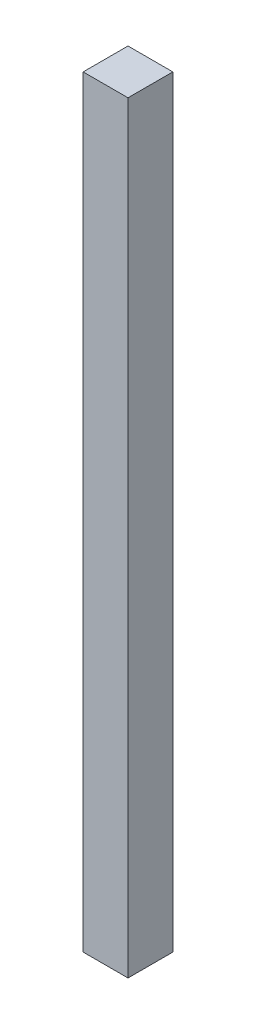
ISO-10303-21;
HEADER;
FILE_DESCRIPTION(('STEP AP214'),'2;1');
FILE_NAME('part.step','',(''),(''),'','','');
FILE_SCHEMA(('AUTOMOTIVE_DESIGN { 1 0 10303 214 1 1 1 1 }'));
ENDSEC;
DATA;
#1=APPLICATION_CONTEXT('core data for automotive mechanical design processes');
#2=APPLICATION_PROTOCOL_DEFINITION('international standard','automotive_design',2000,#1);
#3=PRODUCT_CONTEXT('',#1,'mechanical');
#4=PRODUCT('Part','Part','',(#3));
#5=PRODUCT_RELATED_PRODUCT_CATEGORY('part','',(#4));
#6=PRODUCT_DEFINITION_FORMATION('','',#4);
#7=PRODUCT_DEFINITION_CONTEXT('part definition',#1,'design');
#8=PRODUCT_DEFINITION('design','',#6,#7);
#9=PRODUCT_DEFINITION_SHAPE('','',#8);
#10=(LENGTH_UNIT() NAMED_UNIT(*) SI_UNIT(.MILLI.,.METRE.));
#11=(NAMED_UNIT(*) PLANE_ANGLE_UNIT() SI_UNIT($,.RADIAN.));
#12=(NAMED_UNIT(*) SI_UNIT($,.STERADIAN.) SOLID_ANGLE_UNIT());
#13=UNCERTAINTY_MEASURE_WITH_UNIT(LENGTH_MEASURE(1.E-05),#10,'distance_accuracy_value','');
#14=(GEOMETRIC_REPRESENTATION_CONTEXT(3) GLOBAL_UNCERTAINTY_ASSIGNED_CONTEXT((#13)) GLOBAL_UNIT_ASSIGNED_CONTEXT((#10,
#11,#12)) REPRESENTATION_CONTEXT('',''));
#15=CARTESIAN_POINT('',(0.,0.,0.));
#16=DIRECTION('',(0.,0.,1.));
#17=DIRECTION('',(1.,0.,0.));
#18=AXIS2_PLACEMENT_3D('',#15,#16,#17);
#19=CARTESIAN_POINT('',(12.7000000000003,-215.9,25.4));
#20=DIRECTION('',(-1.,0.,0.));
#21=DIRECTION('',(0.,0.,1.));
#22=AXIS2_PLACEMENT_3D('',#19,#20,#21);
#23=PLANE('',#22);
#24=DIRECTION('',(0.,1.,0.));
#25=VECTOR('',#24,1.);
#26=CARTESIAN_POINT('',(12.7000000000003,-215.9,0.));
#27=LINE('',#26,#25);
#28=CARTESIAN_POINT('',(12.7000000000003,-215.9,0.));
#29=VERTEX_POINT('',#28);
#30=CARTESIAN_POINT('',(12.7000000000003,215.9,0.));
#31=VERTEX_POINT('',#30);
#32=EDGE_CURVE('E96',#29,#31,#27,.T.);
#33=ORIENTED_EDGE('',*,*,#32,.T.);
#34=DIRECTION('',(0.,0.,-1.));
#35=VECTOR('',#34,1.);
#36=CARTESIAN_POINT('',(12.7000000000003,215.9,25.4));
#37=LINE('',#36,#35);
#38=CARTESIAN_POINT('',(12.7000000000003,215.9,25.4));
#39=VERTEX_POINT('',#38);
#40=EDGE_CURVE('E11',#39,#31,#37,.T.);
#41=ORIENTED_EDGE('',*,*,#40,.F.);
#42=DIRECTION('',(0.,1.,0.));
#43=VECTOR('',#42,1.);
#44=CARTESIAN_POINT('',(12.7000000000003,-215.9,25.4));
#45=LINE('',#44,#43);
#46=CARTESIAN_POINT('',(12.7000000000003,-215.9,25.4));
#47=VERTEX_POINT('',#46);
#48=EDGE_CURVE('E84',#47,#39,#45,.T.);
#49=ORIENTED_EDGE('',*,*,#48,.F.);
#50=DIRECTION('',(0.,0.,-1.));
#51=VECTOR('',#50,1.);
#52=CARTESIAN_POINT('',(12.7000000000003,-215.9,25.4));
#53=LINE('',#52,#51);
#54=EDGE_CURVE('E92',#47,#29,#53,.T.);
#55=ORIENTED_EDGE('',*,*,#54,.T.);
#56=EDGE_LOOP('',(#33,#41,#49,#55));
#57=FACE_BOUND('',#56,.T.);
#58=ADVANCED_FACE('F33',(#57),#23,.F.);
#59=CARTESIAN_POINT('',(-12.6999999999998,215.9,25.4));
#60=DIRECTION('',(0.,-1.,0.));
#61=DIRECTION('',(0.,0.,-1.));
#62=AXIS2_PLACEMENT_3D('',#59,#60,#61);
#63=PLANE('',#62);
#64=DIRECTION('',(-1.,0.,0.));
#65=VECTOR('',#64,1.);
#66=CARTESIAN_POINT('',(-12.6999999999998,215.9,0.));
#67=LINE('',#66,#65);
#68=CARTESIAN_POINT('',(-12.6999999999998,215.9,0.));
#69=VERTEX_POINT('',#68);
#70=EDGE_CURVE('E88',#31,#69,#67,.T.);
#71=ORIENTED_EDGE('',*,*,#70,.T.);
#72=DIRECTION('',(0.,0.,-1.));
#73=VECTOR('',#72,1.);
#74=CARTESIAN_POINT('',(-12.6999999999998,215.9,25.4));
#75=LINE('',#74,#73);
#76=CARTESIAN_POINT('',(-12.6999999999998,215.9,25.4));
#77=VERTEX_POINT('',#76);
#78=EDGE_CURVE('E41',#77,#69,#75,.T.);
#79=ORIENTED_EDGE('',*,*,#78,.F.);
#80=DIRECTION('',(-1.,0.,0.));
#81=VECTOR('',#80,1.);
#82=CARTESIAN_POINT('',(-12.6999999999998,215.9,25.4));
#83=LINE('',#82,#81);
#84=EDGE_CURVE('E79',#39,#77,#83,.T.);
#85=ORIENTED_EDGE('',*,*,#84,.F.);
#86=ORIENTED_EDGE('',*,*,#40,.T.);
#87=EDGE_LOOP('',(#71,#79,#85,#86));
#88=FACE_BOUND('',#87,.T.);
#89=ADVANCED_FACE('F87',(#88),#63,.F.);
#90=CARTESIAN_POINT('',(-12.6999999999998,-215.9,25.4));
#91=DIRECTION('',(1.,0.,0.));
#92=DIRECTION('',(0.,0.,-1.));
#93=AXIS2_PLACEMENT_3D('',#90,#91,#92);
#94=PLANE('',#93);
#95=DIRECTION('',(0.,-1.,0.));
#96=VECTOR('',#95,1.);
#97=CARTESIAN_POINT('',(-12.6999999999998,-215.9,0.));
#98=LINE('',#97,#96);
#99=CARTESIAN_POINT('',(-12.6999999999998,-215.9,0.));
#100=VERTEX_POINT('',#99);
#101=EDGE_CURVE('E66',#69,#100,#98,.T.);
#102=ORIENTED_EDGE('',*,*,#101,.T.);
#103=DIRECTION('',(0.,0.,-1.));
#104=VECTOR('',#103,1.);
#105=CARTESIAN_POINT('',(-12.6999999999998,-215.9,25.4));
#106=LINE('',#105,#104);
#107=CARTESIAN_POINT('',(-12.6999999999998,-215.9,25.4));
#108=VERTEX_POINT('',#107);
#109=EDGE_CURVE('E89',#108,#100,#106,.T.);
#110=ORIENTED_EDGE('',*,*,#109,.F.);
#111=DIRECTION('',(0.,-1.,0.));
#112=VECTOR('',#111,1.);
#113=CARTESIAN_POINT('',(-12.6999999999998,-215.9,25.4));
#114=LINE('',#113,#112);
#115=EDGE_CURVE('E82',#77,#108,#114,.T.);
#116=ORIENTED_EDGE('',*,*,#115,.F.);
#117=ORIENTED_EDGE('',*,*,#78,.T.);
#118=EDGE_LOOP('',(#102,#110,#116,#117));
#119=FACE_BOUND('',#118,.T.);
#120=ADVANCED_FACE('F90',(#119),#94,.F.);
#121=CARTESIAN_POINT('',(-12.6999999999998,-215.9,25.4));
#122=DIRECTION('',(0.,1.,0.));
#123=DIRECTION('',(0.,0.,1.));
#124=AXIS2_PLACEMENT_3D('',#121,#122,#123);
#125=PLANE('',#124);
#126=DIRECTION('',(1.,0.,0.));
#127=VECTOR('',#126,1.);
#128=CARTESIAN_POINT('',(-12.6999999999998,-215.9,0.));
#129=LINE('',#128,#127);
#130=EDGE_CURVE('E72',#100,#29,#129,.T.);
#131=ORIENTED_EDGE('',*,*,#130,.T.);
#132=ORIENTED_EDGE('',*,*,#54,.F.);
#133=DIRECTION('',(1.,0.,0.));
#134=VECTOR('',#133,1.);
#135=CARTESIAN_POINT('',(-12.6999999999998,-215.9,25.4));
#136=LINE('',#135,#134);
#137=EDGE_CURVE('E49',#108,#47,#136,.T.);
#138=ORIENTED_EDGE('',*,*,#137,.F.);
#139=ORIENTED_EDGE('',*,*,#109,.T.);
#140=EDGE_LOOP('',(#131,#132,#138,#139));
#141=FACE_BOUND('',#140,.T.);
#142=ADVANCED_FACE('F103',(#141),#125,.F.);
#143=CARTESIAN_POINT('',(0.,0.,25.4));
#144=DIRECTION('',(0.,0.,-1.));
#145=DIRECTION('',(-1.,0.,0.));
#146=AXIS2_PLACEMENT_3D('',#143,#144,#145);
#147=PLANE('',#146);
#148=ORIENTED_EDGE('',*,*,#48,.T.);
#149=ORIENTED_EDGE('',*,*,#84,.T.);
#150=ORIENTED_EDGE('',*,*,#115,.T.);
#151=ORIENTED_EDGE('',*,*,#137,.T.);
#152=EDGE_LOOP('',(#148,#149,#150,#151));
#153=FACE_BOUND('',#152,.T.);
#154=ADVANCED_FACE('F80',(#153),#147,.F.);
#155=CARTESIAN_POINT('',(0.,0.,0.));
#156=DIRECTION('',(0.,0.,-1.));
#157=DIRECTION('',(-1.,0.,0.));
#158=AXIS2_PLACEMENT_3D('',#155,#156,#157);
#159=PLANE('',#158);
#160=ORIENTED_EDGE('',*,*,#32,.F.);
#161=ORIENTED_EDGE('',*,*,#130,.F.);
#162=ORIENTED_EDGE('',*,*,#101,.F.);
#163=ORIENTED_EDGE('',*,*,#70,.F.);
#164=EDGE_LOOP('',(#160,#161,#162,#163));
#165=FACE_BOUND('',#164,.T.);
#166=ADVANCED_FACE('F106',(#165),#159,.T.);
#167=CLOSED_SHELL('',(#58,#89,#120,#142,#154,#166));
#168=MANIFOLD_SOLID_BREP('B2',#167);
#169=ADVANCED_BREP_SHAPE_REPRESENTATION('',(#18,#168),#14);
#170=SHAPE_DEFINITION_REPRESENTATION(#9,#169);
ENDSEC;
END-ISO-10303-21;
